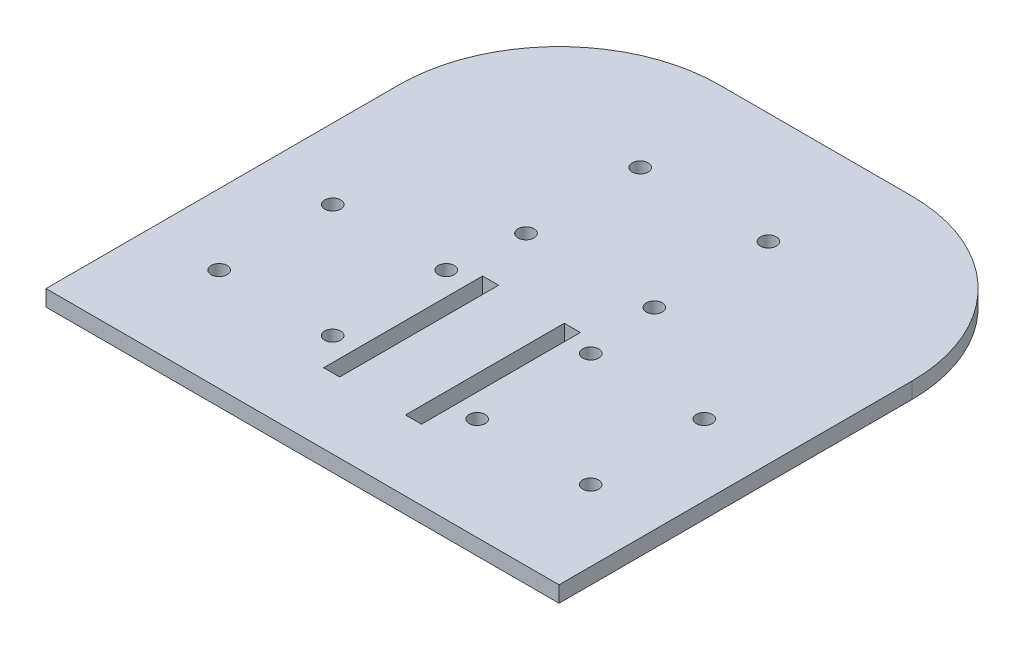
ISO-10303-21;
HEADER;
FILE_DESCRIPTION(('STEP AP214'),'2;1');
FILE_NAME('part.step','',(''),(''),'','','');
FILE_SCHEMA(('AUTOMOTIVE_DESIGN { 1 0 10303 214 1 1 1 1 }'));
ENDSEC;
DATA;
#1=APPLICATION_CONTEXT('core data for automotive mechanical design processes');
#2=APPLICATION_PROTOCOL_DEFINITION('international standard','automotive_design',2000,#1);
#3=PRODUCT_CONTEXT('',#1,'mechanical');
#4=PRODUCT('Part','Part','',(#3));
#5=PRODUCT_RELATED_PRODUCT_CATEGORY('part','',(#4));
#6=PRODUCT_DEFINITION_FORMATION('','',#4);
#7=PRODUCT_DEFINITION_CONTEXT('part definition',#1,'design');
#8=PRODUCT_DEFINITION('design','',#6,#7);
#9=PRODUCT_DEFINITION_SHAPE('','',#8);
#10=(LENGTH_UNIT() NAMED_UNIT(*) SI_UNIT(.MILLI.,.METRE.));
#11=(NAMED_UNIT(*) PLANE_ANGLE_UNIT() SI_UNIT($,.RADIAN.));
#12=(NAMED_UNIT(*) SI_UNIT($,.STERADIAN.) SOLID_ANGLE_UNIT());
#13=UNCERTAINTY_MEASURE_WITH_UNIT(LENGTH_MEASURE(1.E-05),#10,'distance_accuracy_value','');
#14=(GEOMETRIC_REPRESENTATION_CONTEXT(3) GLOBAL_UNCERTAINTY_ASSIGNED_CONTEXT((#13)) GLOBAL_UNIT_ASSIGNED_CONTEXT((#10,
#11,#12)) REPRESENTATION_CONTEXT('',''));
#15=CARTESIAN_POINT('',(0.,0.,0.));
#16=DIRECTION('',(0.,0.,1.));
#17=DIRECTION('',(1.,0.,0.));
#18=AXIS2_PLACEMENT_3D('',#15,#16,#17);
#19=CARTESIAN_POINT('',(101.6,6.35,101.6));
#20=DIRECTION('',(-1.,0.,0.));
#21=DIRECTION('',(0.,0.,1.));
#22=AXIS2_PLACEMENT_3D('',#19,#20,#21);
#23=PLANE('',#22);
#24=DIRECTION('',(0.,1.,0.));
#25=VECTOR('',#24,1.);
#26=CARTESIAN_POINT('',(101.6,0.,-38.0999999999999));
#27=LINE('',#26,#25);
#28=CARTESIAN_POINT('',(101.6,0.,-38.0999999999999));
#29=VERTEX_POINT('',#28);
#30=CARTESIAN_POINT('',(101.6,6.35,-38.0999999999999));
#31=VERTEX_POINT('',#30);
#32=EDGE_CURVE('E228',#29,#31,#27,.T.);
#33=ORIENTED_EDGE('',*,*,#32,.T.);
#34=DIRECTION('',(0.,0.,-1.));
#35=VECTOR('',#34,1.);
#36=CARTESIAN_POINT('',(101.6,6.35,101.6));
#37=LINE('',#36,#35);
#38=CARTESIAN_POINT('',(101.6,6.35,101.6));
#39=VERTEX_POINT('',#38);
#40=EDGE_CURVE('E245',#39,#31,#37,.T.);
#41=ORIENTED_EDGE('',*,*,#40,.F.);
#42=DIRECTION('',(0.,-1.,0.));
#43=VECTOR('',#42,1.);
#44=CARTESIAN_POINT('',(101.6,6.35,101.6));
#45=LINE('',#44,#43);
#46=CARTESIAN_POINT('',(101.6,0.,101.6));
#47=VERTEX_POINT('',#46);
#48=EDGE_CURVE('E39',#39,#47,#45,.T.);
#49=ORIENTED_EDGE('',*,*,#48,.T.);
#50=DIRECTION('',(0.,0.,-1.));
#51=VECTOR('',#50,1.);
#52=CARTESIAN_POINT('',(101.6,0.,101.6));
#53=LINE('',#52,#51);
#54=EDGE_CURVE('E234',#47,#29,#53,.T.);
#55=ORIENTED_EDGE('',*,*,#54,.T.);
#56=EDGE_LOOP('',(#33,#41,#49,#55));
#57=FACE_BOUND('',#56,.T.);
#58=ADVANCED_FACE('F32',(#57),#23,.F.);
#59=CARTESIAN_POINT('',(-101.6,6.35,-101.6));
#60=DIRECTION('',(0.,0.,1.));
#61=DIRECTION('',(1.,0.,0.));
#62=AXIS2_PLACEMENT_3D('',#59,#60,#61);
#63=PLANE('',#62);
#64=DIRECTION('',(-1.,0.,0.));
#65=VECTOR('',#64,1.);
#66=CARTESIAN_POINT('',(-101.6,6.35,-101.6));
#67=LINE('',#66,#65);
#68=CARTESIAN_POINT('',(38.0999999999998,6.35,-101.6));
#69=VERTEX_POINT('',#68);
#70=CARTESIAN_POINT('',(-38.0999999999998,6.35,-101.6));
#71=VERTEX_POINT('',#70);
#72=EDGE_CURVE('E248',#69,#71,#67,.T.);
#73=ORIENTED_EDGE('',*,*,#72,.F.);
#74=DIRECTION('',(0.,1.,0.));
#75=VECTOR('',#74,1.);
#76=CARTESIAN_POINT('',(38.0999999999998,0.,-101.6));
#77=LINE('',#76,#75);
#78=CARTESIAN_POINT('',(38.0999999999998,0.,-101.6));
#79=VERTEX_POINT('',#78);
#80=EDGE_CURVE('E232',#79,#69,#77,.T.);
#81=ORIENTED_EDGE('',*,*,#80,.F.);
#82=DIRECTION('',(-1.,0.,0.));
#83=VECTOR('',#82,1.);
#84=CARTESIAN_POINT('',(-101.6,0.,-101.6));
#85=LINE('',#84,#83);
#86=CARTESIAN_POINT('',(-38.0999999999998,0.,-101.6));
#87=VERTEX_POINT('',#86);
#88=EDGE_CURVE('E258',#79,#87,#85,.T.);
#89=ORIENTED_EDGE('',*,*,#88,.T.);
#90=DIRECTION('',(0.,1.,0.));
#91=VECTOR('',#90,1.);
#92=CARTESIAN_POINT('',(-38.0999999999998,0.,-101.6));
#93=LINE('',#92,#91);
#94=EDGE_CURVE('E240',#87,#71,#93,.T.);
#95=ORIENTED_EDGE('',*,*,#94,.T.);
#96=EDGE_LOOP('',(#73,#81,#89,#95));
#97=FACE_BOUND('',#96,.T.);
#98=ADVANCED_FACE('F281',(#97),#63,.F.);
#99=CARTESIAN_POINT('',(-101.6,6.35,101.6));
#100=DIRECTION('',(1.,0.,0.));
#101=DIRECTION('',(0.,0.,-1.));
#102=AXIS2_PLACEMENT_3D('',#99,#100,#101);
#103=PLANE('',#102);
#104=DIRECTION('',(0.,0.,1.));
#105=VECTOR('',#104,1.);
#106=CARTESIAN_POINT('',(-101.6,6.35,101.6));
#107=LINE('',#106,#105);
#108=CARTESIAN_POINT('',(-101.6,6.35,-38.0999999999999));
#109=VERTEX_POINT('',#108);
#110=CARTESIAN_POINT('',(-101.6,6.35,101.6));
#111=VERTEX_POINT('',#110);
#112=EDGE_CURVE('E252',#109,#111,#107,.T.);
#113=ORIENTED_EDGE('',*,*,#112,.F.);
#114=DIRECTION('',(0.,1.,0.));
#115=VECTOR('',#114,1.);
#116=CARTESIAN_POINT('',(-101.6,0.,-38.0999999999999));
#117=LINE('',#116,#115);
#118=CARTESIAN_POINT('',(-101.6,0.,-38.0999999999999));
#119=VERTEX_POINT('',#118);
#120=EDGE_CURVE('E231',#119,#109,#117,.T.);
#121=ORIENTED_EDGE('',*,*,#120,.F.);
#122=DIRECTION('',(0.,0.,1.));
#123=VECTOR('',#122,1.);
#124=CARTESIAN_POINT('',(-101.6,0.,101.6));
#125=LINE('',#124,#123);
#126=CARTESIAN_POINT('',(-101.6,0.,101.6));
#127=VERTEX_POINT('',#126);
#128=EDGE_CURVE('E261',#119,#127,#125,.T.);
#129=ORIENTED_EDGE('',*,*,#128,.T.);
#130=DIRECTION('',(0.,-1.,0.));
#131=VECTOR('',#130,1.);
#132=CARTESIAN_POINT('',(-101.6,6.35,101.6));
#133=LINE('',#132,#131);
#134=EDGE_CURVE('E11',#111,#127,#133,.T.);
#135=ORIENTED_EDGE('',*,*,#134,.F.);
#136=EDGE_LOOP('',(#113,#121,#129,#135));
#137=FACE_BOUND('',#136,.T.);
#138=ADVANCED_FACE('F288',(#137),#103,.F.);
#139=CARTESIAN_POINT('',(-101.6,6.35,101.6));
#140=DIRECTION('',(0.,0.,-1.));
#141=DIRECTION('',(-1.,0.,0.));
#142=AXIS2_PLACEMENT_3D('',#139,#140,#141);
#143=PLANE('',#142);
#144=DIRECTION('',(1.,0.,0.));
#145=VECTOR('',#144,1.);
#146=CARTESIAN_POINT('',(-101.6,0.,101.6));
#147=LINE('',#146,#145);
#148=EDGE_CURVE('E249',#127,#47,#147,.T.);
#149=ORIENTED_EDGE('',*,*,#148,.T.);
#150=ORIENTED_EDGE('',*,*,#48,.F.);
#151=DIRECTION('',(1.,0.,0.));
#152=VECTOR('',#151,1.);
#153=CARTESIAN_POINT('',(-101.6,6.35,101.6));
#154=LINE('',#153,#152);
#155=EDGE_CURVE('E254',#111,#39,#154,.T.);
#156=ORIENTED_EDGE('',*,*,#155,.F.);
#157=ORIENTED_EDGE('',*,*,#134,.T.);
#158=EDGE_LOOP('',(#149,#150,#156,#157));
#159=FACE_BOUND('',#158,.T.);
#160=ADVANCED_FACE('F286',(#159),#143,.F.);
#161=CARTESIAN_POINT('',(0.,6.35,0.));
#162=DIRECTION('',(0.,-1.,0.));
#163=DIRECTION('',(0.,0.,-1.));
#164=AXIS2_PLACEMENT_3D('',#161,#162,#163);
#165=PLANE('',#164);
#166=CARTESIAN_POINT('',(-28.6962947912317,6.35,60.9657052087683));
#167=DIRECTION('',(0.,-1.,0.));
#168=DIRECTION('',(0.,0.,-1.));
#169=AXIS2_PLACEMENT_3D('',#166,#167,#168);
#170=CIRCLE('',#169,3.175);
#171=CARTESIAN_POINT('',(-28.6962947912317,6.35,57.7907052087683));
#172=VERTEX_POINT('',#171);
#173=EDGE_CURVE('E320',#172,#172,#170,.T.);
#174=ORIENTED_EDGE('',*,*,#173,.T.);
#175=EDGE_LOOP('',(#174));
#176=FACE_BOUND('',#175,.T.);
#177=CARTESIAN_POINT('',(-73.66,6.35,60.9657052087683));
#178=DIRECTION('',(0.,-1.,0.));
#179=DIRECTION('',(0.,0.,-1.));
#180=AXIS2_PLACEMENT_3D('',#177,#178,#179);
#181=CIRCLE('',#180,3.175);
#182=CARTESIAN_POINT('',(-73.66,6.35,57.7907052087683));
#183=VERTEX_POINT('',#182);
#184=EDGE_CURVE('E324',#183,#183,#181,.T.);
#185=ORIENTED_EDGE('',*,*,#184,.T.);
#186=EDGE_LOOP('',(#185));
#187=FACE_BOUND('',#186,.T.);
#188=CARTESIAN_POINT('',(-73.66,6.35,16.002));
#189=DIRECTION('',(0.,-1.,0.));
#190=DIRECTION('',(0.,0.,-1.));
#191=AXIS2_PLACEMENT_3D('',#188,#189,#190);
#192=CIRCLE('',#191,3.175);
#193=CARTESIAN_POINT('',(-73.66,6.35,12.827));
#194=VERTEX_POINT('',#193);
#195=EDGE_CURVE('E328',#194,#194,#192,.T.);
#196=ORIENTED_EDGE('',*,*,#195,.T.);
#197=EDGE_LOOP('',(#196));
#198=FACE_BOUND('',#197,.T.);
#199=CARTESIAN_POINT('',(25.3097438789308,6.35,-57.6128386701625));
#200=DIRECTION('',(0.,-1.,0.));
#201=DIRECTION('',(0.,0.,-1.));
#202=AXIS2_PLACEMENT_3D('',#199,#200,#201);
#203=CIRCLE('',#202,3.175);
#204=CARTESIAN_POINT('',(25.3097438789308,6.35,-60.7878386701625));
#205=VERTEX_POINT('',#204);
#206=EDGE_CURVE('E194',#205,#205,#203,.T.);
#207=ORIENTED_EDGE('',*,*,#206,.T.);
#208=EDGE_LOOP('',(#207));
#209=FACE_BOUND('',#208,.T.);
#210=CARTESIAN_POINT('',(-25.4902561210691,6.35,-57.6128386701626));
#211=DIRECTION('',(0.,-1.,0.));
#212=DIRECTION('',(0.,0.,-1.));
#213=AXIS2_PLACEMENT_3D('',#210,#211,#212);
#214=CIRCLE('',#213,3.175);
#215=CARTESIAN_POINT('',(-25.4902561210691,6.35,-60.7878386701626));
#216=VERTEX_POINT('',#215);
#217=EDGE_CURVE('E188',#216,#216,#214,.T.);
#218=ORIENTED_EDGE('',*,*,#217,.T.);
#219=EDGE_LOOP('',(#218));
#220=FACE_BOUND('',#219,.T.);
#221=CARTESIAN_POINT('',(-25.4902561210691,6.35,-12.4008386701625));
#222=DIRECTION('',(0.,-1.,0.));
#223=DIRECTION('',(0.,0.,-1.));
#224=AXIS2_PLACEMENT_3D('',#221,#222,#223);
#225=CIRCLE('',#224,3.175);
#226=CARTESIAN_POINT('',(-25.4902561210691,6.35,-15.5758386701625));
#227=VERTEX_POINT('',#226);
#228=EDGE_CURVE('E182',#227,#227,#225,.T.);
#229=ORIENTED_EDGE('',*,*,#228,.T.);
#230=EDGE_LOOP('',(#229));
#231=FACE_BOUND('',#230,.T.);
#232=CARTESIAN_POINT('',(25.3097438789308,6.35,-12.4008386701625));
#233=DIRECTION('',(0.,-1.,0.));
#234=DIRECTION('',(0.,0.,-1.));
#235=AXIS2_PLACEMENT_3D('',#232,#233,#234);
#236=CIRCLE('',#235,3.175);
#237=CARTESIAN_POINT('',(25.3097438789308,6.35,-15.5758386701625));
#238=VERTEX_POINT('',#237);
#239=EDGE_CURVE('E167',#238,#238,#236,.T.);
#240=ORIENTED_EDGE('',*,*,#239,.T.);
#241=EDGE_LOOP('',(#240));
#242=FACE_BOUND('',#241,.T.);
#243=DIRECTION('',(-1.,0.,0.));
#244=VECTOR('',#243,1.);
#245=CARTESIAN_POINT('',(12.9315264280242,6.35,73.7559613298375));
#246=LINE('',#245,#244);
#247=CARTESIAN_POINT('',(19.2815264280243,6.35,73.7559613298375));
#248=VERTEX_POINT('',#247);
#249=CARTESIAN_POINT('',(12.9315264280242,6.35,73.7559613298375));
#250=VERTEX_POINT('',#249);
#251=EDGE_CURVE('E144',#248,#250,#246,.T.);
#252=ORIENTED_EDGE('',*,*,#251,.T.);
#253=DIRECTION('',(0.,0.,-1.));
#254=VECTOR('',#253,1.);
#255=CARTESIAN_POINT('',(12.9315264280242,6.35,10.8317438789307));
#256=LINE('',#255,#254);
#257=CARTESIAN_POINT('',(12.9315264280242,6.35,10.8317438789307));
#258=VERTEX_POINT('',#257);
#259=EDGE_CURVE('E136',#250,#258,#256,.T.);
#260=ORIENTED_EDGE('',*,*,#259,.T.);
#261=DIRECTION('',(1.,0.,0.));
#262=VECTOR('',#261,1.);
#263=CARTESIAN_POINT('',(19.2815264280243,6.35,10.8317438789307));
#264=LINE('',#263,#262);
#265=CARTESIAN_POINT('',(19.2815264280243,6.35,10.8317438789307));
#266=VERTEX_POINT('',#265);
#267=EDGE_CURVE('E147',#258,#266,#264,.T.);
#268=ORIENTED_EDGE('',*,*,#267,.T.);
#269=DIRECTION('',(0.,0.,1.));
#270=VECTOR('',#269,1.);
#271=CARTESIAN_POINT('',(19.2815264280243,6.35,73.7559613298375));
#272=LINE('',#271,#270);
#273=EDGE_CURVE('E46',#266,#248,#272,.T.);
#274=ORIENTED_EDGE('',*,*,#273,.T.);
#275=EDGE_LOOP('',(#252,#260,#268,#274));
#276=FACE_BOUND('',#275,.T.);
#277=CARTESIAN_POINT('',(28.5157825490934,6.35,16.002));
#278=DIRECTION('',(0.,-1.,0.));
#279=DIRECTION('',(0.,0.,-1.));
#280=AXIS2_PLACEMENT_3D('',#277,#278,#279);
#281=CIRCLE('',#280,3.175);
#282=CARTESIAN_POINT('',(28.5157825490934,6.35,12.827));
#283=VERTEX_POINT('',#282);
#284=EDGE_CURVE('E590',#283,#283,#281,.T.);
#285=ORIENTED_EDGE('',*,*,#284,.T.);
#286=EDGE_LOOP('',(#285));
#287=FACE_BOUND('',#286,.T.);
#288=CARTESIAN_POINT('',(73.4794877578617,6.35,16.002));
#289=DIRECTION('',(0.,-1.,0.));
#290=DIRECTION('',(0.,0.,-1.));
#291=AXIS2_PLACEMENT_3D('',#288,#289,#290);
#292=CIRCLE('',#291,3.175);
#293=CARTESIAN_POINT('',(73.4794877578617,6.35,12.827));
#294=VERTEX_POINT('',#293);
#295=EDGE_CURVE('E586',#294,#294,#292,.T.);
#296=ORIENTED_EDGE('',*,*,#295,.T.);
#297=EDGE_LOOP('',(#296));
#298=FACE_BOUND('',#297,.T.);
#299=CARTESIAN_POINT('',(73.4794877578616,6.35,60.9657052087683));
#300=DIRECTION('',(0.,-1.,0.));
#301=DIRECTION('',(0.,0.,-1.));
#302=AXIS2_PLACEMENT_3D('',#299,#300,#301);
#303=CIRCLE('',#302,3.175);
#304=CARTESIAN_POINT('',(73.4794877578616,6.35,57.7907052087683));
#305=VERTEX_POINT('',#304);
#306=EDGE_CURVE('E582',#305,#305,#303,.T.);
#307=ORIENTED_EDGE('',*,*,#306,.T.);
#308=EDGE_LOOP('',(#307));
#309=FACE_BOUND('',#308,.T.);
#310=CARTESIAN_POINT('',(28.5157825490934,6.35,60.9657052087683));
#311=DIRECTION('',(0.,-1.,0.));
#312=DIRECTION('',(0.,0.,-1.));
#313=AXIS2_PLACEMENT_3D('',#310,#311,#312);
#314=CIRCLE('',#313,3.175);
#315=CARTESIAN_POINT('',(28.5157825490934,6.35,57.7907052087683));
#316=VERTEX_POINT('',#315);
#317=EDGE_CURVE('E574',#316,#316,#314,.T.);
#318=ORIENTED_EDGE('',*,*,#317,.T.);
#319=EDGE_LOOP('',(#318));
#320=FACE_BOUND('',#319,.T.);
#321=CARTESIAN_POINT('',(-28.6962947912317,6.35,16.0020000000001));
#322=DIRECTION('',(0.,-1.,0.));
#323=DIRECTION('',(0.,0.,-1.));
#324=AXIS2_PLACEMENT_3D('',#321,#322,#323);
#325=CIRCLE('',#324,3.175);
#326=CARTESIAN_POINT('',(-28.6962947912317,6.35,12.8270000000001));
#327=VERTEX_POINT('',#326);
#328=EDGE_CURVE('E568',#327,#327,#325,.T.);
#329=ORIENTED_EDGE('',*,*,#328,.T.);
#330=EDGE_LOOP('',(#329));
#331=FACE_BOUND('',#330,.T.);
#332=DIRECTION('',(-1.,0.,0.));
#333=VECTOR('',#332,1.);
#334=CARTESIAN_POINT('',(-13.1120386701626,6.35,73.7559613298375));
#335=LINE('',#334,#333);
#336=CARTESIAN_POINT('',(-13.1120386701626,6.35,73.7559613298375));
#337=VERTEX_POINT('',#336);
#338=CARTESIAN_POINT('',(-19.4620386701627,6.35,73.7559613298375));
#339=VERTEX_POINT('',#338);
#340=EDGE_CURVE('E203',#337,#339,#335,.T.);
#341=ORIENTED_EDGE('',*,*,#340,.T.);
#342=DIRECTION('',(0.,0.,-1.));
#343=VECTOR('',#342,1.);
#344=CARTESIAN_POINT('',(-19.4620386701627,6.35,73.7559613298375));
#345=LINE('',#344,#343);
#346=CARTESIAN_POINT('',(-19.4620386701626,6.35,10.8317438789309));
#347=VERTEX_POINT('',#346);
#348=EDGE_CURVE('E195',#339,#347,#345,.T.);
#349=ORIENTED_EDGE('',*,*,#348,.T.);
#350=DIRECTION('',(1.,0.,0.));
#351=VECTOR('',#350,1.);
#352=CARTESIAN_POINT('',(-19.4620386701626,6.35,10.8317438789309));
#353=LINE('',#352,#351);
#354=CARTESIAN_POINT('',(-13.1120386701626,6.35,10.8317438789309));
#355=VERTEX_POINT('',#354);
#356=EDGE_CURVE('E198',#347,#355,#353,.T.);
#357=ORIENTED_EDGE('',*,*,#356,.T.);
#358=DIRECTION('',(0.,0.,1.));
#359=VECTOR('',#358,1.);
#360=CARTESIAN_POINT('',(-13.1120386701626,6.35,10.8317438789309));
#361=LINE('',#360,#359);
#362=EDGE_CURVE('E54',#355,#337,#361,.T.);
#363=ORIENTED_EDGE('',*,*,#362,.T.);
#364=EDGE_LOOP('',(#341,#349,#357,#363));
#365=FACE_BOUND('',#364,.T.);
#366=ORIENTED_EDGE('',*,*,#40,.T.);
#367=CARTESIAN_POINT('',(38.0999999999998,6.35,-38.0999999999999));
#368=DIRECTION('',(0.,-1.,0.));
#369=DIRECTION('',(0.,0.,1.));
#370=AXIS2_PLACEMENT_3D('',#367,#368,#369);
#371=CIRCLE('',#370,63.5000000000001);
#372=EDGE_CURVE('E229',#69,#31,#371,.T.);
#373=ORIENTED_EDGE('',*,*,#372,.F.);
#374=ORIENTED_EDGE('',*,*,#72,.T.);
#375=CARTESIAN_POINT('',(-38.0999999999998,6.35,-38.0999999999999));
#376=DIRECTION('',(0.,-1.,0.));
#377=DIRECTION('',(0.,0.,-1.));
#378=AXIS2_PLACEMENT_3D('',#375,#376,#377);
#379=CIRCLE('',#378,63.5000000000001);
#380=EDGE_CURVE('E218',#109,#71,#379,.T.);
#381=ORIENTED_EDGE('',*,*,#380,.F.);
#382=ORIENTED_EDGE('',*,*,#112,.T.);
#383=ORIENTED_EDGE('',*,*,#155,.T.);
#384=EDGE_LOOP('',(#366,#373,#374,#381,#382,#383));
#385=FACE_BOUND('',#384,.T.);
#386=ADVANCED_FACE('F151',(#176,#187,#198,#209,#220,#231,#242,#276,#287,#298,#309,#320,#331,
#365,#385),#165,.F.);
#387=CARTESIAN_POINT('',(0.,0.,0.));
#388=DIRECTION('',(0.,-1.,0.));
#389=DIRECTION('',(0.,0.,-1.));
#390=AXIS2_PLACEMENT_3D('',#387,#388,#389);
#391=PLANE('',#390);
#392=CARTESIAN_POINT('',(-28.6962947912317,0.,60.9657052087683));
#393=DIRECTION('',(0.,-1.,0.));
#394=DIRECTION('',(0.,0.,-1.));
#395=AXIS2_PLACEMENT_3D('',#392,#393,#394);
#396=CIRCLE('',#395,3.175);
#397=CARTESIAN_POINT('',(-28.6962947912317,0.,57.7907052087683));
#398=VERTEX_POINT('',#397);
#399=EDGE_CURVE('E160',#398,#398,#396,.T.);
#400=ORIENTED_EDGE('',*,*,#399,.F.);
#401=EDGE_LOOP('',(#400));
#402=FACE_BOUND('',#401,.T.);
#403=CARTESIAN_POINT('',(-73.66,0.,60.9657052087683));
#404=DIRECTION('',(0.,-1.,0.));
#405=DIRECTION('',(0.,0.,-1.));
#406=AXIS2_PLACEMENT_3D('',#403,#404,#405);
#407=CIRCLE('',#406,3.175);
#408=CARTESIAN_POINT('',(-73.66,0.,57.7907052087683));
#409=VERTEX_POINT('',#408);
#410=EDGE_CURVE('E569',#409,#409,#407,.T.);
#411=ORIENTED_EDGE('',*,*,#410,.F.);
#412=EDGE_LOOP('',(#411));
#413=FACE_BOUND('',#412,.T.);
#414=CARTESIAN_POINT('',(-73.66,0.,16.002));
#415=DIRECTION('',(0.,-1.,0.));
#416=DIRECTION('',(0.,0.,-1.));
#417=AXIS2_PLACEMENT_3D('',#414,#415,#416);
#418=CIRCLE('',#417,3.175);
#419=CARTESIAN_POINT('',(-73.66,0.,12.827));
#420=VERTEX_POINT('',#419);
#421=EDGE_CURVE('E596',#420,#420,#418,.T.);
#422=ORIENTED_EDGE('',*,*,#421,.F.);
#423=EDGE_LOOP('',(#422));
#424=FACE_BOUND('',#423,.T.);
#425=CARTESIAN_POINT('',(25.3097438789308,0.,-57.6128386701625));
#426=DIRECTION('',(0.,-1.,0.));
#427=DIRECTION('',(0.,0.,-1.));
#428=AXIS2_PLACEMENT_3D('',#425,#426,#427);
#429=CIRCLE('',#428,3.175);
#430=CARTESIAN_POINT('',(25.3097438789308,0.,-60.7878386701625));
#431=VERTEX_POINT('',#430);
#432=EDGE_CURVE('E592',#431,#431,#429,.T.);
#433=ORIENTED_EDGE('',*,*,#432,.F.);
#434=EDGE_LOOP('',(#433));
#435=FACE_BOUND('',#434,.T.);
#436=CARTESIAN_POINT('',(-25.4902561210691,0.,-57.6128386701626));
#437=DIRECTION('',(0.,-1.,0.));
#438=DIRECTION('',(0.,0.,-1.));
#439=AXIS2_PLACEMENT_3D('',#436,#437,#438);
#440=CIRCLE('',#439,3.175);
#441=CARTESIAN_POINT('',(-25.4902561210691,0.,-60.7878386701626));
#442=VERTEX_POINT('',#441);
#443=EDGE_CURVE('E191',#442,#442,#440,.T.);
#444=ORIENTED_EDGE('',*,*,#443,.F.);
#445=EDGE_LOOP('',(#444));
#446=FACE_BOUND('',#445,.T.);
#447=CARTESIAN_POINT('',(-25.4902561210691,0.,-12.4008386701625));
#448=DIRECTION('',(0.,-1.,0.));
#449=DIRECTION('',(0.,0.,-1.));
#450=AXIS2_PLACEMENT_3D('',#447,#448,#449);
#451=CIRCLE('',#450,3.175);
#452=CARTESIAN_POINT('',(-25.4902561210691,0.,-15.5758386701625));
#453=VERTEX_POINT('',#452);
#454=EDGE_CURVE('E185',#453,#453,#451,.T.);
#455=ORIENTED_EDGE('',*,*,#454,.F.);
#456=EDGE_LOOP('',(#455));
#457=FACE_BOUND('',#456,.T.);
#458=CARTESIAN_POINT('',(25.3097438789308,0.,-12.4008386701625));
#459=DIRECTION('',(0.,-1.,0.));
#460=DIRECTION('',(0.,0.,-1.));
#461=AXIS2_PLACEMENT_3D('',#458,#459,#460);
#462=CIRCLE('',#461,3.175);
#463=CARTESIAN_POINT('',(25.3097438789308,0.,-15.5758386701625));
#464=VERTEX_POINT('',#463);
#465=EDGE_CURVE('E179',#464,#464,#462,.T.);
#466=ORIENTED_EDGE('',*,*,#465,.F.);
#467=EDGE_LOOP('',(#466));
#468=FACE_BOUND('',#467,.T.);
#469=DIRECTION('',(0.,0.,-1.));
#470=VECTOR('',#469,1.);
#471=CARTESIAN_POINT('',(12.9315264280242,0.,10.8317438789307));
#472=LINE('',#471,#470);
#473=CARTESIAN_POINT('',(12.9315264280242,0.,73.7559613298375));
#474=VERTEX_POINT('',#473);
#475=CARTESIAN_POINT('',(12.9315264280242,0.,10.8317438789307));
#476=VERTEX_POINT('',#475);
#477=EDGE_CURVE('E139',#474,#476,#472,.T.);
#478=ORIENTED_EDGE('',*,*,#477,.F.);
#479=DIRECTION('',(-1.,0.,0.));
#480=VECTOR('',#479,1.);
#481=CARTESIAN_POINT('',(12.9315264280242,0.,73.7559613298375));
#482=LINE('',#481,#480);
#483=CARTESIAN_POINT('',(19.2815264280243,0.,73.7559613298375));
#484=VERTEX_POINT('',#483);
#485=EDGE_CURVE('E154',#484,#474,#482,.T.);
#486=ORIENTED_EDGE('',*,*,#485,.F.);
#487=DIRECTION('',(0.,0.,1.));
#488=VECTOR('',#487,1.);
#489=CARTESIAN_POINT('',(19.2815264280243,0.,73.7559613298375));
#490=LINE('',#489,#488);
#491=CARTESIAN_POINT('',(19.2815264280243,0.,10.8317438789307));
#492=VERTEX_POINT('',#491);
#493=EDGE_CURVE('E157',#492,#484,#490,.T.);
#494=ORIENTED_EDGE('',*,*,#493,.F.);
#495=DIRECTION('',(1.,0.,0.));
#496=VECTOR('',#495,1.);
#497=CARTESIAN_POINT('',(19.2815264280243,0.,10.8317438789307));
#498=LINE('',#497,#496);
#499=EDGE_CURVE('E166',#476,#492,#498,.T.);
#500=ORIENTED_EDGE('',*,*,#499,.F.);
#501=EDGE_LOOP('',(#478,#486,#494,#500));
#502=FACE_BOUND('',#501,.T.);
#503=CARTESIAN_POINT('',(28.5157825490934,0.,16.002));
#504=DIRECTION('',(0.,-1.,0.));
#505=DIRECTION('',(0.,0.,-1.));
#506=AXIS2_PLACEMENT_3D('',#503,#504,#505);
#507=CIRCLE('',#506,3.175);
#508=CARTESIAN_POINT('',(28.5157825490934,0.,12.827));
#509=VERTEX_POINT('',#508);
#510=EDGE_CURVE('E351',#509,#509,#507,.T.);
#511=ORIENTED_EDGE('',*,*,#510,.F.);
#512=EDGE_LOOP('',(#511));
#513=FACE_BOUND('',#512,.T.);
#514=CARTESIAN_POINT('',(73.4794877578617,0.,16.002));
#515=DIRECTION('',(0.,-1.,0.));
#516=DIRECTION('',(0.,0.,-1.));
#517=AXIS2_PLACEMENT_3D('',#514,#515,#516);
#518=CIRCLE('',#517,3.175);
#519=CARTESIAN_POINT('',(73.4794877578617,0.,12.827));
#520=VERTEX_POINT('',#519);
#521=EDGE_CURVE('E355',#520,#520,#518,.T.);
#522=ORIENTED_EDGE('',*,*,#521,.F.);
#523=EDGE_LOOP('',(#522));
#524=FACE_BOUND('',#523,.T.);
#525=CARTESIAN_POINT('',(73.4794877578616,0.,60.9657052087683));
#526=DIRECTION('',(0.,-1.,0.));
#527=DIRECTION('',(0.,0.,-1.));
#528=AXIS2_PLACEMENT_3D('',#525,#526,#527);
#529=CIRCLE('',#528,3.175);
#530=CARTESIAN_POINT('',(73.4794877578616,0.,57.7907052087683));
#531=VERTEX_POINT('',#530);
#532=EDGE_CURVE('E359',#531,#531,#529,.T.);
#533=ORIENTED_EDGE('',*,*,#532,.F.);
#534=EDGE_LOOP('',(#533));
#535=FACE_BOUND('',#534,.T.);
#536=CARTESIAN_POINT('',(28.5157825490934,0.,60.9657052087683));
#537=DIRECTION('',(0.,-1.,0.));
#538=DIRECTION('',(0.,0.,-1.));
#539=AXIS2_PLACEMENT_3D('',#536,#537,#538);
#540=CIRCLE('',#539,3.175);
#541=CARTESIAN_POINT('',(28.5157825490934,0.,57.7907052087683));
#542=VERTEX_POINT('',#541);
#543=EDGE_CURVE('E363',#542,#542,#540,.T.);
#544=ORIENTED_EDGE('',*,*,#543,.F.);
#545=EDGE_LOOP('',(#544));
#546=FACE_BOUND('',#545,.T.);
#547=CARTESIAN_POINT('',(-28.6962947912317,0.,16.0020000000001));
#548=DIRECTION('',(0.,-1.,0.));
#549=DIRECTION('',(0.,0.,-1.));
#550=AXIS2_PLACEMENT_3D('',#547,#548,#549);
#551=CIRCLE('',#550,3.175);
#552=CARTESIAN_POINT('',(-28.6962947912317,0.,12.8270000000001));
#553=VERTEX_POINT('',#552);
#554=EDGE_CURVE('E367',#553,#553,#551,.T.);
#555=ORIENTED_EDGE('',*,*,#554,.F.);
#556=EDGE_LOOP('',(#555));
#557=FACE_BOUND('',#556,.T.);
#558=DIRECTION('',(0.,0.,-1.));
#559=VECTOR('',#558,1.);
#560=CARTESIAN_POINT('',(-19.4620386701627,0.,73.7559613298375));
#561=LINE('',#560,#559);
#562=CARTESIAN_POINT('',(-19.4620386701627,0.,73.7559613298375));
#563=VERTEX_POINT('',#562);
#564=CARTESIAN_POINT('',(-19.4620386701626,0.,10.8317438789309));
#565=VERTEX_POINT('',#564);
#566=EDGE_CURVE('E173',#563,#565,#561,.T.);
#567=ORIENTED_EDGE('',*,*,#566,.F.);
#568=DIRECTION('',(-1.,0.,0.));
#569=VECTOR('',#568,1.);
#570=CARTESIAN_POINT('',(-13.1120386701626,0.,73.7559613298375));
#571=LINE('',#570,#569);
#572=CARTESIAN_POINT('',(-13.1120386701626,0.,73.7559613298375));
#573=VERTEX_POINT('',#572);
#574=EDGE_CURVE('E199',#573,#563,#571,.T.);
#575=ORIENTED_EDGE('',*,*,#574,.F.);
#576=DIRECTION('',(0.,0.,1.));
#577=VECTOR('',#576,1.);
#578=CARTESIAN_POINT('',(-13.1120386701626,0.,10.8317438789309));
#579=LINE('',#578,#577);
#580=CARTESIAN_POINT('',(-13.1120386701626,0.,10.8317438789309));
#581=VERTEX_POINT('',#580);
#582=EDGE_CURVE('E211',#581,#573,#579,.T.);
#583=ORIENTED_EDGE('',*,*,#582,.F.);
#584=DIRECTION('',(1.,0.,0.));
#585=VECTOR('',#584,1.);
#586=CARTESIAN_POINT('',(-19.4620386701626,0.,10.8317438789309));
#587=LINE('',#586,#585);
#588=EDGE_CURVE('E208',#565,#581,#587,.T.);
#589=ORIENTED_EDGE('',*,*,#588,.F.);
#590=EDGE_LOOP('',(#567,#575,#583,#589));
#591=FACE_BOUND('',#590,.T.);
#592=CARTESIAN_POINT('',(38.0999999999998,0.,-38.0999999999999));
#593=DIRECTION('',(0.,-1.,0.));
#594=DIRECTION('',(0.,0.,1.));
#595=AXIS2_PLACEMENT_3D('',#592,#593,#594);
#596=CIRCLE('',#595,63.5000000000001);
#597=EDGE_CURVE('E225',#79,#29,#596,.T.);
#598=ORIENTED_EDGE('',*,*,#597,.T.);
#599=ORIENTED_EDGE('',*,*,#54,.F.);
#600=ORIENTED_EDGE('',*,*,#148,.F.);
#601=ORIENTED_EDGE('',*,*,#128,.F.);
#602=CARTESIAN_POINT('',(-38.0999999999998,0.,-38.0999999999999));
#603=DIRECTION('',(0.,-1.,0.));
#604=DIRECTION('',(0.,0.,-1.));
#605=AXIS2_PLACEMENT_3D('',#602,#603,#604);
#606=CIRCLE('',#605,63.5000000000001);
#607=EDGE_CURVE('E237',#119,#87,#606,.T.);
#608=ORIENTED_EDGE('',*,*,#607,.T.);
#609=ORIENTED_EDGE('',*,*,#88,.F.);
#610=EDGE_LOOP('',(#598,#599,#600,#601,#608,#609));
#611=FACE_BOUND('',#610,.T.);
#612=ADVANCED_FACE('F272',(#402,#413,#424,#435,#446,#457,#468,#502,#513,#524,#535,#546,#557,
#591,#611),#391,.T.);
#613=CARTESIAN_POINT('',(-38.0999999999998,0.,-38.0999999999999));
#614=DIRECTION('',(0.,1.,0.));
#615=DIRECTION('',(0.,0.,1.));
#616=AXIS2_PLACEMENT_3D('',#613,#614,#615);
#617=CYLINDRICAL_SURFACE('',#616,63.5000000000001);
#618=ORIENTED_EDGE('',*,*,#380,.T.);
#619=ORIENTED_EDGE('',*,*,#94,.F.);
#620=ORIENTED_EDGE('',*,*,#607,.F.);
#621=ORIENTED_EDGE('',*,*,#120,.T.);
#622=EDGE_LOOP('',(#618,#619,#620,#621));
#623=FACE_BOUND('',#622,.T.);
#624=ADVANCED_FACE('F291',(#623),#617,.T.);
#625=CARTESIAN_POINT('',(38.0999999999998,0.,-38.0999999999999));
#626=DIRECTION('',(0.,1.,0.));
#627=DIRECTION('',(0.,0.,1.));
#628=AXIS2_PLACEMENT_3D('',#625,#626,#627);
#629=CYLINDRICAL_SURFACE('',#628,63.5000000000001);
#630=ORIENTED_EDGE('',*,*,#372,.T.);
#631=ORIENTED_EDGE('',*,*,#32,.F.);
#632=ORIENTED_EDGE('',*,*,#597,.F.);
#633=ORIENTED_EDGE('',*,*,#80,.T.);
#634=EDGE_LOOP('',(#630,#631,#632,#633));
#635=FACE_BOUND('',#634,.T.);
#636=ADVANCED_FACE('F277',(#635),#629,.T.);
#637=CARTESIAN_POINT('',(-19.4620386701627,6.35,73.7559613298375));
#638=DIRECTION('',(-1.,0.,0.));
#639=DIRECTION('',(0.,0.,1.));
#640=AXIS2_PLACEMENT_3D('',#637,#638,#639);
#641=PLANE('',#640);
#642=ORIENTED_EDGE('',*,*,#566,.T.);
#643=DIRECTION('',(0.,-1.,0.));
#644=VECTOR('',#643,1.);
#645=CARTESIAN_POINT('',(-19.4620386701626,6.35,10.8317438789309));
#646=LINE('',#645,#644);
#647=EDGE_CURVE('E206',#347,#565,#646,.T.);
#648=ORIENTED_EDGE('',*,*,#647,.F.);
#649=ORIENTED_EDGE('',*,*,#348,.F.);
#650=DIRECTION('',(0.,-1.,0.));
#651=VECTOR('',#650,1.);
#652=CARTESIAN_POINT('',(-19.4620386701627,6.35,73.7559613298375));
#653=LINE('',#652,#651);
#654=EDGE_CURVE('E216',#339,#563,#653,.T.);
#655=ORIENTED_EDGE('',*,*,#654,.T.);
#656=EDGE_LOOP('',(#642,#648,#649,#655));
#657=FACE_BOUND('',#656,.T.);
#658=ADVANCED_FACE('F298',(#657),#641,.F.);
#659=CARTESIAN_POINT('',(-13.1120386701626,6.35,73.7559613298375));
#660=DIRECTION('',(0.,0.,1.));
#661=DIRECTION('',(1.,0.,0.));
#662=AXIS2_PLACEMENT_3D('',#659,#660,#661);
#663=PLANE('',#662);
#664=ORIENTED_EDGE('',*,*,#574,.T.);
#665=ORIENTED_EDGE('',*,*,#654,.F.);
#666=ORIENTED_EDGE('',*,*,#340,.F.);
#667=DIRECTION('',(0.,-1.,0.));
#668=VECTOR('',#667,1.);
#669=CARTESIAN_POINT('',(-13.1120386701626,6.35,73.7559613298375));
#670=LINE('',#669,#668);
#671=EDGE_CURVE('E219',#337,#573,#670,.T.);
#672=ORIENTED_EDGE('',*,*,#671,.T.);
#673=EDGE_LOOP('',(#664,#665,#666,#672));
#674=FACE_BOUND('',#673,.T.);
#675=ADVANCED_FACE('F380',(#674),#663,.F.);
#676=CARTESIAN_POINT('',(-13.1120386701626,6.35,10.8317438789309));
#677=DIRECTION('',(1.,0.,0.));
#678=DIRECTION('',(0.,0.,-1.));
#679=AXIS2_PLACEMENT_3D('',#676,#677,#678);
#680=PLANE('',#679);
#681=ORIENTED_EDGE('',*,*,#582,.T.);
#682=ORIENTED_EDGE('',*,*,#671,.F.);
#683=ORIENTED_EDGE('',*,*,#362,.F.);
#684=DIRECTION('',(0.,-1.,0.));
#685=VECTOR('',#684,1.);
#686=CARTESIAN_POINT('',(-13.1120386701626,6.35,10.8317438789309));
#687=LINE('',#686,#685);
#688=EDGE_CURVE('E221',#355,#581,#687,.T.);
#689=ORIENTED_EDGE('',*,*,#688,.T.);
#690=EDGE_LOOP('',(#681,#682,#683,#689));
#691=FACE_BOUND('',#690,.T.);
#692=ADVANCED_FACE('F381',(#691),#680,.F.);
#693=CARTESIAN_POINT('',(-19.4620386701626,6.35,10.8317438789309));
#694=DIRECTION('',(0.,0.,-1.));
#695=DIRECTION('',(-1.,0.,0.));
#696=AXIS2_PLACEMENT_3D('',#693,#694,#695);
#697=PLANE('',#696);
#698=ORIENTED_EDGE('',*,*,#588,.T.);
#699=ORIENTED_EDGE('',*,*,#688,.F.);
#700=ORIENTED_EDGE('',*,*,#356,.F.);
#701=ORIENTED_EDGE('',*,*,#647,.T.);
#702=EDGE_LOOP('',(#698,#699,#700,#701));
#703=FACE_BOUND('',#702,.T.);
#704=ADVANCED_FACE('F376',(#703),#697,.F.);
#705=CARTESIAN_POINT('',(-28.6962947912317,6.35,16.0020000000001));
#706=DIRECTION('',(0.,-1.,0.));
#707=DIRECTION('',(0.,0.,-1.));
#708=AXIS2_PLACEMENT_3D('',#705,#706,#707);
#709=CYLINDRICAL_SURFACE('',#708,3.175);
#710=ORIENTED_EDGE('',*,*,#328,.F.);
#711=EDGE_LOOP('',(#710));
#712=FACE_BOUND('',#711,.T.);
#713=ORIENTED_EDGE('',*,*,#554,.T.);
#714=EDGE_LOOP('',(#713));
#715=FACE_BOUND('',#714,.T.);
#716=ADVANCED_FACE('F388',(#712,#715),#709,.F.);
#717=CARTESIAN_POINT('',(28.5157825490934,6.35,60.9657052087683));
#718=DIRECTION('',(0.,-1.,0.));
#719=DIRECTION('',(0.,0.,-1.));
#720=AXIS2_PLACEMENT_3D('',#717,#718,#719);
#721=CYLINDRICAL_SURFACE('',#720,3.175);
#722=ORIENTED_EDGE('',*,*,#317,.F.);
#723=EDGE_LOOP('',(#722));
#724=FACE_BOUND('',#723,.T.);
#725=ORIENTED_EDGE('',*,*,#543,.T.);
#726=EDGE_LOOP('',(#725));
#727=FACE_BOUND('',#726,.T.);
#728=ADVANCED_FACE('F422',(#724,#727),#721,.F.);
#729=CARTESIAN_POINT('',(73.4794877578616,6.35,60.9657052087683));
#730=DIRECTION('',(0.,-1.,0.));
#731=DIRECTION('',(0.,0.,-1.));
#732=AXIS2_PLACEMENT_3D('',#729,#730,#731);
#733=CYLINDRICAL_SURFACE('',#732,3.175);
#734=ORIENTED_EDGE('',*,*,#306,.F.);
#735=EDGE_LOOP('',(#734));
#736=FACE_BOUND('',#735,.T.);
#737=ORIENTED_EDGE('',*,*,#532,.T.);
#738=EDGE_LOOP('',(#737));
#739=FACE_BOUND('',#738,.T.);
#740=ADVANCED_FACE('F432',(#736,#739),#733,.F.);
#741=CARTESIAN_POINT('',(73.4794877578617,6.35,16.002));
#742=DIRECTION('',(0.,-1.,0.));
#743=DIRECTION('',(0.,0.,-1.));
#744=AXIS2_PLACEMENT_3D('',#741,#742,#743);
#745=CYLINDRICAL_SURFACE('',#744,3.175);
#746=ORIENTED_EDGE('',*,*,#295,.F.);
#747=EDGE_LOOP('',(#746));
#748=FACE_BOUND('',#747,.T.);
#749=ORIENTED_EDGE('',*,*,#521,.T.);
#750=EDGE_LOOP('',(#749));
#751=FACE_BOUND('',#750,.T.);
#752=ADVANCED_FACE('F442',(#748,#751),#745,.F.);
#753=CARTESIAN_POINT('',(28.5157825490934,6.35,16.002));
#754=DIRECTION('',(0.,-1.,0.));
#755=DIRECTION('',(0.,0.,-1.));
#756=AXIS2_PLACEMENT_3D('',#753,#754,#755);
#757=CYLINDRICAL_SURFACE('',#756,3.175);
#758=ORIENTED_EDGE('',*,*,#284,.F.);
#759=EDGE_LOOP('',(#758));
#760=FACE_BOUND('',#759,.T.);
#761=ORIENTED_EDGE('',*,*,#510,.T.);
#762=EDGE_LOOP('',(#761));
#763=FACE_BOUND('',#762,.T.);
#764=ADVANCED_FACE('F452',(#760,#763),#757,.F.);
#765=CARTESIAN_POINT('',(12.9315264280242,6.35,10.8317438789307));
#766=DIRECTION('',(-1.,0.,0.));
#767=DIRECTION('',(0.,0.,1.));
#768=AXIS2_PLACEMENT_3D('',#765,#766,#767);
#769=PLANE('',#768);
#770=ORIENTED_EDGE('',*,*,#477,.T.);
#771=DIRECTION('',(0.,-1.,0.));
#772=VECTOR('',#771,1.);
#773=CARTESIAN_POINT('',(12.9315264280242,6.35,10.8317438789307));
#774=LINE('',#773,#772);
#775=EDGE_CURVE('E132',#258,#476,#774,.T.);
#776=ORIENTED_EDGE('',*,*,#775,.F.);
#777=ORIENTED_EDGE('',*,*,#259,.F.);
#778=DIRECTION('',(0.,-1.,0.));
#779=VECTOR('',#778,1.);
#780=CARTESIAN_POINT('',(12.9315264280242,6.35,73.7559613298375));
#781=LINE('',#780,#779);
#782=EDGE_CURVE('E171',#250,#474,#781,.T.);
#783=ORIENTED_EDGE('',*,*,#782,.T.);
#784=EDGE_LOOP('',(#770,#776,#777,#783));
#785=FACE_BOUND('',#784,.T.);
#786=ADVANCED_FACE('F134',(#785),#769,.F.);
#787=CARTESIAN_POINT('',(12.9315264280242,6.35,73.7559613298375));
#788=DIRECTION('',(0.,0.,1.));
#789=DIRECTION('',(1.,0.,0.));
#790=AXIS2_PLACEMENT_3D('',#787,#788,#789);
#791=PLANE('',#790);
#792=ORIENTED_EDGE('',*,*,#485,.T.);
#793=ORIENTED_EDGE('',*,*,#782,.F.);
#794=ORIENTED_EDGE('',*,*,#251,.F.);
#795=DIRECTION('',(0.,-1.,0.));
#796=VECTOR('',#795,1.);
#797=CARTESIAN_POINT('',(19.2815264280243,6.35,73.7559613298375));
#798=LINE('',#797,#796);
#799=EDGE_CURVE('E174',#248,#484,#798,.T.);
#800=ORIENTED_EDGE('',*,*,#799,.T.);
#801=EDGE_LOOP('',(#792,#793,#794,#800));
#802=FACE_BOUND('',#801,.T.);
#803=ADVANCED_FACE('F471',(#802),#791,.F.);
#804=CARTESIAN_POINT('',(19.2815264280243,6.35,73.7559613298375));
#805=DIRECTION('',(1.,0.,0.));
#806=DIRECTION('',(0.,0.,-1.));
#807=AXIS2_PLACEMENT_3D('',#804,#805,#806);
#808=PLANE('',#807);
#809=ORIENTED_EDGE('',*,*,#493,.T.);
#810=ORIENTED_EDGE('',*,*,#799,.F.);
#811=ORIENTED_EDGE('',*,*,#273,.F.);
#812=DIRECTION('',(0.,-1.,0.));
#813=VECTOR('',#812,1.);
#814=CARTESIAN_POINT('',(19.2815264280243,6.35,10.8317438789307));
#815=LINE('',#814,#813);
#816=EDGE_CURVE('E143',#266,#492,#815,.T.);
#817=ORIENTED_EDGE('',*,*,#816,.T.);
#818=EDGE_LOOP('',(#809,#810,#811,#817));
#819=FACE_BOUND('',#818,.T.);
#820=ADVANCED_FACE('F480',(#819),#808,.F.);
#821=CARTESIAN_POINT('',(19.2815264280243,6.35,10.8317438789307));
#822=DIRECTION('',(0.,0.,-1.));
#823=DIRECTION('',(-1.,0.,0.));
#824=AXIS2_PLACEMENT_3D('',#821,#822,#823);
#825=PLANE('',#824);
#826=ORIENTED_EDGE('',*,*,#499,.T.);
#827=ORIENTED_EDGE('',*,*,#816,.F.);
#828=ORIENTED_EDGE('',*,*,#267,.F.);
#829=ORIENTED_EDGE('',*,*,#775,.T.);
#830=EDGE_LOOP('',(#826,#827,#828,#829));
#831=FACE_BOUND('',#830,.T.);
#832=ADVANCED_FACE('F148',(#831),#825,.F.);
#833=CARTESIAN_POINT('',(25.3097438789308,6.35,-12.4008386701625));
#834=DIRECTION('',(0.,-1.,0.));
#835=DIRECTION('',(0.,0.,-1.));
#836=AXIS2_PLACEMENT_3D('',#833,#834,#835);
#837=CYLINDRICAL_SURFACE('',#836,3.175);
#838=ORIENTED_EDGE('',*,*,#239,.F.);
#839=EDGE_LOOP('',(#838));
#840=FACE_BOUND('',#839,.T.);
#841=ORIENTED_EDGE('',*,*,#465,.T.);
#842=EDGE_LOOP('',(#841));
#843=FACE_BOUND('',#842,.T.);
#844=ADVANCED_FACE('F338',(#840,#843),#837,.F.);
#845=CARTESIAN_POINT('',(-25.4902561210691,6.35,-12.4008386701625));
#846=DIRECTION('',(0.,-1.,0.));
#847=DIRECTION('',(0.,0.,-1.));
#848=AXIS2_PLACEMENT_3D('',#845,#846,#847);
#849=CYLINDRICAL_SURFACE('',#848,3.175);
#850=ORIENTED_EDGE('',*,*,#228,.F.);
#851=EDGE_LOOP('',(#850));
#852=FACE_BOUND('',#851,.T.);
#853=ORIENTED_EDGE('',*,*,#454,.T.);
#854=EDGE_LOOP('',(#853));
#855=FACE_BOUND('',#854,.T.);
#856=ADVANCED_FACE('F341',(#852,#855),#849,.F.);
#857=CARTESIAN_POINT('',(-25.4902561210691,6.35,-57.6128386701626));
#858=DIRECTION('',(0.,-1.,0.));
#859=DIRECTION('',(0.,0.,-1.));
#860=AXIS2_PLACEMENT_3D('',#857,#858,#859);
#861=CYLINDRICAL_SURFACE('',#860,3.175);
#862=ORIENTED_EDGE('',*,*,#217,.F.);
#863=EDGE_LOOP('',(#862));
#864=FACE_BOUND('',#863,.T.);
#865=ORIENTED_EDGE('',*,*,#443,.T.);
#866=EDGE_LOOP('',(#865));
#867=FACE_BOUND('',#866,.T.);
#868=ADVANCED_FACE('F512',(#864,#867),#861,.F.);
#869=CARTESIAN_POINT('',(25.3097438789308,6.35,-57.6128386701625));
#870=DIRECTION('',(0.,-1.,0.));
#871=DIRECTION('',(0.,0.,-1.));
#872=AXIS2_PLACEMENT_3D('',#869,#870,#871);
#873=CYLINDRICAL_SURFACE('',#872,3.175);
#874=ORIENTED_EDGE('',*,*,#206,.F.);
#875=EDGE_LOOP('',(#874));
#876=FACE_BOUND('',#875,.T.);
#877=ORIENTED_EDGE('',*,*,#432,.T.);
#878=EDGE_LOOP('',(#877));
#879=FACE_BOUND('',#878,.T.);
#880=ADVANCED_FACE('F522',(#876,#879),#873,.F.);
#881=CARTESIAN_POINT('',(-73.66,6.35,16.002));
#882=DIRECTION('',(0.,-1.,0.));
#883=DIRECTION('',(0.,0.,-1.));
#884=AXIS2_PLACEMENT_3D('',#881,#882,#883);
#885=CYLINDRICAL_SURFACE('',#884,3.175);
#886=ORIENTED_EDGE('',*,*,#195,.F.);
#887=EDGE_LOOP('',(#886));
#888=FACE_BOUND('',#887,.T.);
#889=ORIENTED_EDGE('',*,*,#421,.T.);
#890=EDGE_LOOP('',(#889));
#891=FACE_BOUND('',#890,.T.);
#892=ADVANCED_FACE('F531',(#888,#891),#885,.F.);
#893=CARTESIAN_POINT('',(-73.66,6.35,60.9657052087683));
#894=DIRECTION('',(0.,-1.,0.));
#895=DIRECTION('',(0.,0.,-1.));
#896=AXIS2_PLACEMENT_3D('',#893,#894,#895);
#897=CYLINDRICAL_SURFACE('',#896,3.175);
#898=ORIENTED_EDGE('',*,*,#184,.F.);
#899=EDGE_LOOP('',(#898));
#900=FACE_BOUND('',#899,.T.);
#901=ORIENTED_EDGE('',*,*,#410,.T.);
#902=EDGE_LOOP('',(#901));
#903=FACE_BOUND('',#902,.T.);
#904=ADVANCED_FACE('F541',(#900,#903),#897,.F.);
#905=CARTESIAN_POINT('',(-28.6962947912317,6.35,60.9657052087683));
#906=DIRECTION('',(0.,-1.,0.));
#907=DIRECTION('',(0.,0.,-1.));
#908=AXIS2_PLACEMENT_3D('',#905,#906,#907);
#909=CYLINDRICAL_SURFACE('',#908,3.175);
#910=ORIENTED_EDGE('',*,*,#173,.F.);
#911=EDGE_LOOP('',(#910));
#912=FACE_BOUND('',#911,.T.);
#913=ORIENTED_EDGE('',*,*,#399,.T.);
#914=EDGE_LOOP('',(#913));
#915=FACE_BOUND('',#914,.T.);
#916=ADVANCED_FACE('F551',(#912,#915),#909,.F.);
#917=CLOSED_SHELL('',(#58,#98,#138,#160,#386,#612,#624,#636,#658,#675,#692,#704,#716,#728,#740,
#752,#764,#786,#803,#820,#832,#844,#856,#868,#880,#892,#904,#916));
#918=MANIFOLD_SOLID_BREP('B2',#917);
#919=ADVANCED_BREP_SHAPE_REPRESENTATION('',(#18,#918),#14);
#920=SHAPE_DEFINITION_REPRESENTATION(#9,#919);
ENDSEC;
END-ISO-10303-21;
